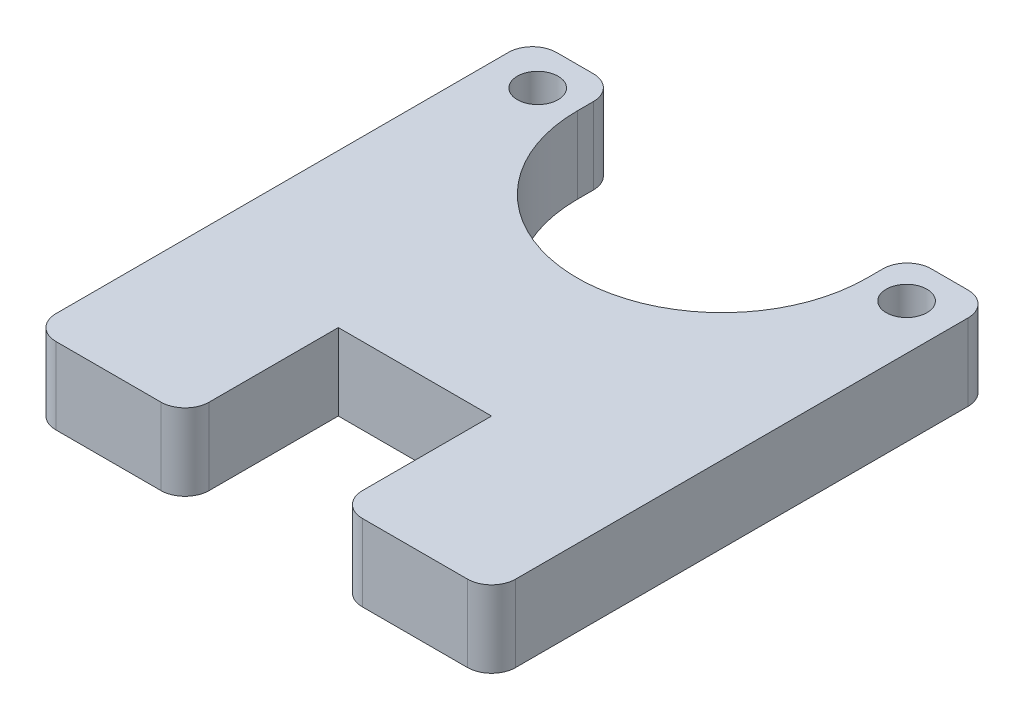
ISO-10303-21;
HEADER;
FILE_DESCRIPTION(('STEP AP214'),'2;1');
FILE_NAME('part.step','',(''),(''),'','','');
FILE_SCHEMA(('AUTOMOTIVE_DESIGN { 1 0 10303 214 1 1 1 1 }'));
ENDSEC;
DATA;
#1=APPLICATION_CONTEXT('core data for automotive mechanical design processes');
#2=APPLICATION_PROTOCOL_DEFINITION('international standard','automotive_design',2000,#1);
#3=PRODUCT_CONTEXT('',#1,'mechanical');
#4=PRODUCT('Part','Part','',(#3));
#5=PRODUCT_RELATED_PRODUCT_CATEGORY('part','',(#4));
#6=PRODUCT_DEFINITION_FORMATION('','',#4);
#7=PRODUCT_DEFINITION_CONTEXT('part definition',#1,'design');
#8=PRODUCT_DEFINITION('design','',#6,#7);
#9=PRODUCT_DEFINITION_SHAPE('','',#8);
#10=(LENGTH_UNIT() NAMED_UNIT(*) SI_UNIT(.MILLI.,.METRE.));
#11=(NAMED_UNIT(*) PLANE_ANGLE_UNIT() SI_UNIT($,.RADIAN.));
#12=(NAMED_UNIT(*) SI_UNIT($,.STERADIAN.) SOLID_ANGLE_UNIT());
#13=UNCERTAINTY_MEASURE_WITH_UNIT(LENGTH_MEASURE(1.E-05),#10,'distance_accuracy_value','');
#14=(GEOMETRIC_REPRESENTATION_CONTEXT(3) GLOBAL_UNCERTAINTY_ASSIGNED_CONTEXT((#13)) GLOBAL_UNIT_ASSIGNED_CONTEXT((#10,
#11,#12)) REPRESENTATION_CONTEXT('',''));
#15=CARTESIAN_POINT('',(0.,0.,0.));
#16=DIRECTION('',(0.,0.,1.));
#17=DIRECTION('',(1.,0.,0.));
#18=AXIS2_PLACEMENT_3D('',#15,#16,#17);
#19=CARTESIAN_POINT('',(19.05,3.175,0.));
#20=DIRECTION('',(-1.,0.,0.));
#21=DIRECTION('',(0.,0.,1.));
#22=AXIS2_PLACEMENT_3D('',#19,#20,#21);
#23=PLANE('',#22);
#24=DIRECTION('',(0.,0.,-1.));
#25=VECTOR('',#24,1.);
#26=CARTESIAN_POINT('',(19.05,3.175,0.));
#27=LINE('',#26,#25);
#28=CARTESIAN_POINT('',(19.05,3.175,5.35));
#29=VERTEX_POINT('',#28);
#30=CARTESIAN_POINT('',(19.05,3.175,-13.393639996));
#31=VERTEX_POINT('',#30);
#32=EDGE_CURVE('E269',#29,#31,#27,.T.);
#33=ORIENTED_EDGE('',*,*,#32,.F.);
#34=DIRECTION('',(0.,-1.,0.));
#35=VECTOR('',#34,1.);
#36=CARTESIAN_POINT('',(19.05,0.,5.35));
#37=LINE('',#36,#35);
#38=CARTESIAN_POINT('',(19.05,0.,5.35));
#39=VERTEX_POINT('',#38);
#40=EDGE_CURVE('E276',#29,#39,#37,.T.);
#41=ORIENTED_EDGE('',*,*,#40,.T.);
#42=DIRECTION('',(0.,0.,-1.));
#43=VECTOR('',#42,1.);
#44=CARTESIAN_POINT('',(19.05,0.,0.));
#45=LINE('',#44,#43);
#46=CARTESIAN_POINT('',(19.05,0.,-13.393639996));
#47=VERTEX_POINT('',#46);
#48=EDGE_CURVE('E232',#39,#47,#45,.T.);
#49=ORIENTED_EDGE('',*,*,#48,.T.);
#50=DIRECTION('',(0.,-1.,0.));
#51=VECTOR('',#50,1.);
#52=CARTESIAN_POINT('',(19.05,3.175,-13.393639996));
#53=LINE('',#52,#51);
#54=EDGE_CURVE('E187',#47,#31,#53,.F.);
#55=ORIENTED_EDGE('',*,*,#54,.T.);
#56=EDGE_LOOP('',(#33,#41,#49,#55));
#57=FACE_BOUND('',#56,.T.);
#58=ADVANCED_FACE('F35',(#57),#23,.F.);
#59=CARTESIAN_POINT('',(0.,3.175,-14.393639996));
#60=DIRECTION('',(0.,0.,1.));
#61=DIRECTION('',(1.,0.,0.));
#62=AXIS2_PLACEMENT_3D('',#59,#60,#61);
#63=PLANE('',#62);
#64=DIRECTION('',(-1.,0.,0.));
#65=VECTOR('',#64,1.);
#66=CARTESIAN_POINT('',(0.,3.175,-14.393639996));
#67=LINE('',#66,#65);
#68=CARTESIAN_POINT('',(18.05,3.175,-14.393639996));
#69=VERTEX_POINT('',#68);
#70=CARTESIAN_POINT('',(16.5250007,3.175,-14.393639996));
#71=VERTEX_POINT('',#70);
#72=EDGE_CURVE('E199',#69,#71,#67,.T.);
#73=ORIENTED_EDGE('',*,*,#72,.F.);
#74=DIRECTION('',(0.,-1.,0.));
#75=VECTOR('',#74,1.);
#76=CARTESIAN_POINT('',(18.05,3.175,-14.393639996));
#77=LINE('',#76,#75);
#78=CARTESIAN_POINT('',(18.05,0.,-14.393639996));
#79=VERTEX_POINT('',#78);
#80=EDGE_CURVE('E330',#69,#79,#77,.T.);
#81=ORIENTED_EDGE('',*,*,#80,.T.);
#82=DIRECTION('',(-1.,0.,0.));
#83=VECTOR('',#82,1.);
#84=CARTESIAN_POINT('',(0.,0.,-14.393639996));
#85=LINE('',#84,#83);
#86=CARTESIAN_POINT('',(16.5250007,0.,-14.393639996));
#87=VERTEX_POINT('',#86);
#88=EDGE_CURVE('E235',#79,#87,#85,.T.);
#89=ORIENTED_EDGE('',*,*,#88,.T.);
#90=DIRECTION('',(0.,-1.,0.));
#91=VECTOR('',#90,1.);
#92=CARTESIAN_POINT('',(16.5250007,3.175,-14.393639996));
#93=LINE('',#92,#91);
#94=EDGE_CURVE('E328',#87,#71,#93,.F.);
#95=ORIENTED_EDGE('',*,*,#94,.T.);
#96=EDGE_LOOP('',(#73,#81,#89,#95));
#97=FACE_BOUND('',#96,.T.);
#98=ADVANCED_FACE('F394',(#97),#63,.F.);
#99=CARTESIAN_POINT('',(15.5250007,3.175,0.));
#100=DIRECTION('',(-1.,0.,0.));
#101=DIRECTION('',(0.,0.,1.));
#102=AXIS2_PLACEMENT_3D('',#99,#100,#101);
#103=PLANE('',#102);
#104=DIRECTION('',(0.,0.,-1.));
#105=VECTOR('',#104,1.);
#106=CARTESIAN_POINT('',(15.5250007,3.175,0.));
#107=LINE('',#106,#105);
#108=CARTESIAN_POINT('',(15.5250007,3.175,-12.728637738));
#109=VERTEX_POINT('',#108);
#110=CARTESIAN_POINT('',(15.5250007,3.175,-13.393639996));
#111=VERTEX_POINT('',#110);
#112=EDGE_CURVE('E179',#109,#111,#107,.T.);
#113=ORIENTED_EDGE('',*,*,#112,.T.);
#114=DIRECTION('',(0.,-1.,0.));
#115=VECTOR('',#114,1.);
#116=CARTESIAN_POINT('',(15.5250007,0.,-13.393639996));
#117=LINE('',#116,#115);
#118=CARTESIAN_POINT('',(15.5250007,0.,-13.393639996));
#119=VERTEX_POINT('',#118);
#120=EDGE_CURVE('E333',#111,#119,#117,.T.);
#121=ORIENTED_EDGE('',*,*,#120,.T.);
#122=DIRECTION('',(0.,0.,-1.));
#123=VECTOR('',#122,1.);
#124=CARTESIAN_POINT('',(15.5250007,0.,0.));
#125=LINE('',#124,#123);
#126=CARTESIAN_POINT('',(15.5250007,0.,-12.728637738));
#127=VERTEX_POINT('',#126);
#128=EDGE_CURVE('E182',#127,#119,#125,.T.);
#129=ORIENTED_EDGE('',*,*,#128,.F.);
#130=DIRECTION('',(0.,-1.,0.));
#131=VECTOR('',#130,1.);
#132=CARTESIAN_POINT('',(15.5250007,3.175,-12.728637738));
#133=LINE('',#132,#131);
#134=EDGE_CURVE('E175',#109,#127,#133,.T.);
#135=ORIENTED_EDGE('',*,*,#134,.F.);
#136=EDGE_LOOP('',(#113,#121,#129,#135));
#137=FACE_BOUND('',#136,.T.);
#138=ADVANCED_FACE('F177',(#137),#103,.T.);
#139=CARTESIAN_POINT('',(9.525,3.175,-12.728637738));
#140=DIRECTION('',(0.,-1.,0.));
#141=DIRECTION('',(0.,0.,-1.));
#142=AXIS2_PLACEMENT_3D('',#139,#140,#141);
#143=CYLINDRICAL_SURFACE('',#142,6.0000007);
#144=CARTESIAN_POINT('',(9.525,0.,-12.728637738));
#145=DIRECTION('',(0.,1.,0.));
#146=DIRECTION('',(0.,0.,1.));
#147=AXIS2_PLACEMENT_3D('',#144,#145,#146);
#148=CIRCLE('',#147,6.0000007);
#149=CARTESIAN_POINT('',(3.52499930000392,0.,-12.728637738));
#150=VERTEX_POINT('',#149);
#151=EDGE_CURVE('E239',#150,#127,#148,.T.);
#152=ORIENTED_EDGE('',*,*,#151,.F.);
#153=DIRECTION('',(0.,-1.,0.));
#154=VECTOR('',#153,1.);
#155=CARTESIAN_POINT('',(3.52499930000392,3.175,-12.728637738));
#156=LINE('',#155,#154);
#157=CARTESIAN_POINT('',(3.52499930000392,3.175,-12.728637738));
#158=VERTEX_POINT('',#157);
#159=EDGE_CURVE('E188',#158,#150,#156,.T.);
#160=ORIENTED_EDGE('',*,*,#159,.F.);
#161=CARTESIAN_POINT('',(9.525,3.175,-12.728637738));
#162=DIRECTION('',(0.,1.,0.));
#163=DIRECTION('',(0.,0.,1.));
#164=AXIS2_PLACEMENT_3D('',#161,#162,#163);
#165=CIRCLE('',#164,6.0000007);
#166=EDGE_CURVE('E195',#158,#109,#165,.T.);
#167=ORIENTED_EDGE('',*,*,#166,.T.);
#168=ORIENTED_EDGE('',*,*,#134,.T.);
#169=EDGE_LOOP('',(#152,#160,#167,#168));
#170=FACE_BOUND('',#169,.T.);
#171=ADVANCED_FACE('F201',(#170),#143,.F.);
#172=CARTESIAN_POINT('',(3.52499930000392,3.175,0.));
#173=DIRECTION('',(-1.,0.,0.));
#174=DIRECTION('',(0.,0.,1.));
#175=AXIS2_PLACEMENT_3D('',#172,#173,#174);
#176=PLANE('',#175);
#177=DIRECTION('',(0.,0.,-1.));
#178=VECTOR('',#177,1.);
#179=CARTESIAN_POINT('',(3.52499930000392,0.,0.));
#180=LINE('',#179,#178);
#181=CARTESIAN_POINT('',(3.52499930000392,0.,-13.393639996));
#182=VERTEX_POINT('',#181);
#183=EDGE_CURVE('E241',#150,#182,#180,.T.);
#184=ORIENTED_EDGE('',*,*,#183,.T.);
#185=DIRECTION('',(0.,-1.,0.));
#186=VECTOR('',#185,1.);
#187=CARTESIAN_POINT('',(3.52499930000392,3.175,-13.393639996));
#188=LINE('',#187,#186);
#189=CARTESIAN_POINT('',(3.52499930000392,3.175,-13.393639996));
#190=VERTEX_POINT('',#189);
#191=EDGE_CURVE('E11',#182,#190,#188,.F.);
#192=ORIENTED_EDGE('',*,*,#191,.T.);
#193=DIRECTION('',(0.,0.,-1.));
#194=VECTOR('',#193,1.);
#195=CARTESIAN_POINT('',(3.52499930000392,3.175,0.));
#196=LINE('',#195,#194);
#197=EDGE_CURVE('E203',#158,#190,#196,.T.);
#198=ORIENTED_EDGE('',*,*,#197,.F.);
#199=ORIENTED_EDGE('',*,*,#159,.T.);
#200=EDGE_LOOP('',(#184,#192,#198,#199));
#201=FACE_BOUND('',#200,.T.);
#202=ADVANCED_FACE('F431',(#201),#176,.F.);
#203=CARTESIAN_POINT('',(0.,3.175,-14.393639996));
#204=DIRECTION('',(0.,0.,-1.));
#205=DIRECTION('',(-1.,0.,0.));
#206=AXIS2_PLACEMENT_3D('',#203,#204,#205);
#207=PLANE('',#206);
#208=DIRECTION('',(1.,0.,0.));
#209=VECTOR('',#208,1.);
#210=CARTESIAN_POINT('',(0.,3.175,-14.393639996));
#211=LINE('',#210,#209);
#212=CARTESIAN_POINT('',(1.,3.175,-14.393639996));
#213=VERTEX_POINT('',#212);
#214=CARTESIAN_POINT('',(2.52499930000392,3.175,-14.393639996));
#215=VERTEX_POINT('',#214);
#216=EDGE_CURVE('E205',#213,#215,#211,.T.);
#217=ORIENTED_EDGE('',*,*,#216,.T.);
#218=DIRECTION('',(0.,-1.,0.));
#219=VECTOR('',#218,1.);
#220=CARTESIAN_POINT('',(2.52499930000392,0.,-14.393639996));
#221=LINE('',#220,#219);
#222=CARTESIAN_POINT('',(2.52499930000392,0.,-14.393639996));
#223=VERTEX_POINT('',#222);
#224=EDGE_CURVE('E43',#215,#223,#221,.T.);
#225=ORIENTED_EDGE('',*,*,#224,.T.);
#226=DIRECTION('',(1.,0.,0.));
#227=VECTOR('',#226,1.);
#228=CARTESIAN_POINT('',(0.,0.,-14.393639996));
#229=LINE('',#228,#227);
#230=CARTESIAN_POINT('',(1.,0.,-14.393639996));
#231=VERTEX_POINT('',#230);
#232=EDGE_CURVE('E244',#231,#223,#229,.T.);
#233=ORIENTED_EDGE('',*,*,#232,.F.);
#234=DIRECTION('',(0.,-1.,0.));
#235=VECTOR('',#234,1.);
#236=CARTESIAN_POINT('',(1.,3.175,-14.393639996));
#237=LINE('',#236,#235);
#238=EDGE_CURVE('E335',#231,#213,#237,.F.);
#239=ORIENTED_EDGE('',*,*,#238,.T.);
#240=EDGE_LOOP('',(#217,#225,#233,#239));
#241=FACE_BOUND('',#240,.T.);
#242=ADVANCED_FACE('F340',(#241),#207,.T.);
#243=CARTESIAN_POINT('',(0.,3.175,0.));
#244=DIRECTION('',(-1.,0.,0.));
#245=DIRECTION('',(0.,0.,1.));
#246=AXIS2_PLACEMENT_3D('',#243,#244,#245);
#247=PLANE('',#246);
#248=DIRECTION('',(0.,0.,-1.));
#249=VECTOR('',#248,1.);
#250=CARTESIAN_POINT('',(0.,0.,0.));
#251=LINE('',#250,#249);
#252=CARTESIAN_POINT('',(0.,0.,5.35));
#253=VERTEX_POINT('',#252);
#254=CARTESIAN_POINT('',(0.,0.,-13.393639996));
#255=VERTEX_POINT('',#254);
#256=EDGE_CURVE('E247',#253,#255,#251,.T.);
#257=ORIENTED_EDGE('',*,*,#256,.F.);
#258=DIRECTION('',(0.,-1.,0.));
#259=VECTOR('',#258,1.);
#260=CARTESIAN_POINT('',(0.,3.175,5.35));
#261=LINE('',#260,#259);
#262=CARTESIAN_POINT('',(0.,3.175,5.35));
#263=VERTEX_POINT('',#262);
#264=EDGE_CURVE('E326',#253,#263,#261,.F.);
#265=ORIENTED_EDGE('',*,*,#264,.T.);
#266=DIRECTION('',(0.,0.,-1.));
#267=VECTOR('',#266,1.);
#268=CARTESIAN_POINT('',(0.,3.175,0.));
#269=LINE('',#268,#267);
#270=CARTESIAN_POINT('',(0.,3.175,-13.393639996));
#271=VERTEX_POINT('',#270);
#272=EDGE_CURVE('E211',#263,#271,#269,.T.);
#273=ORIENTED_EDGE('',*,*,#272,.T.);
#274=DIRECTION('',(0.,-1.,0.));
#275=VECTOR('',#274,1.);
#276=CARTESIAN_POINT('',(0.,3.175,-13.393639996));
#277=LINE('',#276,#275);
#278=EDGE_CURVE('E323',#271,#255,#277,.T.);
#279=ORIENTED_EDGE('',*,*,#278,.T.);
#280=EDGE_LOOP('',(#257,#265,#273,#279));
#281=FACE_BOUND('',#280,.T.);
#282=ADVANCED_FACE('F355',(#281),#247,.T.);
#283=CARTESIAN_POINT('',(0.,3.175,6.35));
#284=DIRECTION('',(0.,0.,-1.));
#285=DIRECTION('',(-1.,0.,0.));
#286=AXIS2_PLACEMENT_3D('',#283,#284,#285);
#287=PLANE('',#286);
#288=DIRECTION('',(1.,0.,0.));
#289=VECTOR('',#288,1.);
#290=CARTESIAN_POINT('',(0.,0.,6.35));
#291=LINE('',#290,#289);
#292=CARTESIAN_POINT('',(1.00000000000001,0.,6.35));
#293=VERTEX_POINT('',#292);
#294=CARTESIAN_POINT('',(5.35,0.,6.35));
#295=VERTEX_POINT('',#294);
#296=EDGE_CURVE('E250',#293,#295,#291,.T.);
#297=ORIENTED_EDGE('',*,*,#296,.T.);
#298=DIRECTION('',(0.,-1.,0.));
#299=VECTOR('',#298,1.);
#300=CARTESIAN_POINT('',(5.35,3.175,6.35));
#301=LINE('',#300,#299);
#302=CARTESIAN_POINT('',(5.35,3.175,6.35));
#303=VERTEX_POINT('',#302);
#304=EDGE_CURVE('E321',#295,#303,#301,.F.);
#305=ORIENTED_EDGE('',*,*,#304,.T.);
#306=DIRECTION('',(1.,0.,0.));
#307=VECTOR('',#306,1.);
#308=CARTESIAN_POINT('',(0.,3.175,6.35));
#309=LINE('',#308,#307);
#310=CARTESIAN_POINT('',(1.00000000000001,3.175,6.35));
#311=VERTEX_POINT('',#310);
#312=EDGE_CURVE('E214',#311,#303,#309,.T.);
#313=ORIENTED_EDGE('',*,*,#312,.F.);
#314=DIRECTION('',(0.,-1.,0.));
#315=VECTOR('',#314,1.);
#316=CARTESIAN_POINT('',(1.00000000000001,0.,6.35));
#317=LINE('',#316,#315);
#318=EDGE_CURVE('E318',#311,#293,#317,.T.);
#319=ORIENTED_EDGE('',*,*,#318,.T.);
#320=EDGE_LOOP('',(#297,#305,#313,#319));
#321=FACE_BOUND('',#320,.T.);
#322=ADVANCED_FACE('F365',(#321),#287,.F.);
#323=CARTESIAN_POINT('',(6.35,3.175,0.));
#324=DIRECTION('',(1.,0.,0.));
#325=DIRECTION('',(0.,0.,-1.));
#326=AXIS2_PLACEMENT_3D('',#323,#324,#325);
#327=PLANE('',#326);
#328=DIRECTION('',(0.,0.,1.));
#329=VECTOR('',#328,1.);
#330=CARTESIAN_POINT('',(6.35,3.175,0.));
#331=LINE('',#330,#329);
#332=CARTESIAN_POINT('',(6.35,3.175,0.));
#333=VERTEX_POINT('',#332);
#334=CARTESIAN_POINT('',(6.35,3.175,5.35));
#335=VERTEX_POINT('',#334);
#336=EDGE_CURVE('E216',#333,#335,#331,.T.);
#337=ORIENTED_EDGE('',*,*,#336,.T.);
#338=DIRECTION('',(0.,-1.,0.));
#339=VECTOR('',#338,1.);
#340=CARTESIAN_POINT('',(6.35,0.,5.35));
#341=LINE('',#340,#339);
#342=CARTESIAN_POINT('',(6.35,0.,5.35));
#343=VERTEX_POINT('',#342);
#344=EDGE_CURVE('E315',#335,#343,#341,.T.);
#345=ORIENTED_EDGE('',*,*,#344,.T.);
#346=DIRECTION('',(0.,0.,1.));
#347=VECTOR('',#346,1.);
#348=CARTESIAN_POINT('',(6.35,0.,0.));
#349=LINE('',#348,#347);
#350=CARTESIAN_POINT('',(6.35,0.,0.));
#351=VERTEX_POINT('',#350);
#352=EDGE_CURVE('E253',#351,#343,#349,.T.);
#353=ORIENTED_EDGE('',*,*,#352,.F.);
#354=DIRECTION('',(0.,-1.,0.));
#355=VECTOR('',#354,1.);
#356=CARTESIAN_POINT('',(6.35,3.175,0.));
#357=LINE('',#356,#355);
#358=EDGE_CURVE('E272',#333,#351,#357,.T.);
#359=ORIENTED_EDGE('',*,*,#358,.F.);
#360=EDGE_LOOP('',(#337,#345,#353,#359));
#361=FACE_BOUND('',#360,.T.);
#362=ADVANCED_FACE('F373',(#361),#327,.T.);
#363=CARTESIAN_POINT('',(0.,3.175,0.));
#364=DIRECTION('',(0.,0.,-1.));
#365=DIRECTION('',(-1.,0.,0.));
#366=AXIS2_PLACEMENT_3D('',#363,#364,#365);
#367=PLANE('',#366);
#368=DIRECTION('',(1.,0.,0.));
#369=VECTOR('',#368,1.);
#370=CARTESIAN_POINT('',(0.,0.,0.));
#371=LINE('',#370,#369);
#372=CARTESIAN_POINT('',(12.7,0.,0.));
#373=VERTEX_POINT('',#372);
#374=EDGE_CURVE('E256',#351,#373,#371,.T.);
#375=ORIENTED_EDGE('',*,*,#374,.T.);
#376=DIRECTION('',(0.,-1.,0.));
#377=VECTOR('',#376,1.);
#378=CARTESIAN_POINT('',(12.7,3.175,0.));
#379=LINE('',#378,#377);
#380=CARTESIAN_POINT('',(12.7,3.175,0.));
#381=VERTEX_POINT('',#380);
#382=EDGE_CURVE('E231',#381,#373,#379,.T.);
#383=ORIENTED_EDGE('',*,*,#382,.F.);
#384=DIRECTION('',(1.,0.,0.));
#385=VECTOR('',#384,1.);
#386=CARTESIAN_POINT('',(0.,3.175,0.));
#387=LINE('',#386,#385);
#388=EDGE_CURVE('E218',#333,#381,#387,.T.);
#389=ORIENTED_EDGE('',*,*,#388,.F.);
#390=ORIENTED_EDGE('',*,*,#358,.T.);
#391=EDGE_LOOP('',(#375,#383,#389,#390));
#392=FACE_BOUND('',#391,.T.);
#393=ADVANCED_FACE('F378',(#392),#367,.F.);
#394=CARTESIAN_POINT('',(12.7,3.175,0.));
#395=DIRECTION('',(1.,0.,0.));
#396=DIRECTION('',(0.,0.,-1.));
#397=AXIS2_PLACEMENT_3D('',#394,#395,#396);
#398=PLANE('',#397);
#399=DIRECTION('',(0.,0.,1.));
#400=VECTOR('',#399,1.);
#401=CARTESIAN_POINT('',(12.7,0.,0.));
#402=LINE('',#401,#400);
#403=CARTESIAN_POINT('',(12.7,0.,5.35));
#404=VERTEX_POINT('',#403);
#405=EDGE_CURVE('E258',#373,#404,#402,.T.);
#406=ORIENTED_EDGE('',*,*,#405,.T.);
#407=DIRECTION('',(0.,-1.,0.));
#408=VECTOR('',#407,1.);
#409=CARTESIAN_POINT('',(12.7,3.175,5.35));
#410=LINE('',#409,#408);
#411=CARTESIAN_POINT('',(12.7,3.175,5.35));
#412=VERTEX_POINT('',#411);
#413=EDGE_CURVE('E50',#404,#412,#410,.F.);
#414=ORIENTED_EDGE('',*,*,#413,.T.);
#415=DIRECTION('',(0.,0.,1.));
#416=VECTOR('',#415,1.);
#417=CARTESIAN_POINT('',(12.7,3.175,0.));
#418=LINE('',#417,#416);
#419=EDGE_CURVE('E220',#381,#412,#418,.T.);
#420=ORIENTED_EDGE('',*,*,#419,.F.);
#421=ORIENTED_EDGE('',*,*,#382,.T.);
#422=EDGE_LOOP('',(#406,#414,#420,#421));
#423=FACE_BOUND('',#422,.T.);
#424=ADVANCED_FACE('F380',(#423),#398,.F.);
#425=CARTESIAN_POINT('',(1.88250068000392,3.175,-12.728644596));
#426=DIRECTION('',(0.,-1.,0.));
#427=DIRECTION('',(0.,0.,-1.));
#428=AXIS2_PLACEMENT_3D('',#425,#426,#427);
#429=CYLINDRICAL_SURFACE('',#428,0.8449945);
#430=CARTESIAN_POINT('',(1.88250068000392,3.175,-12.728644596));
#431=DIRECTION('',(0.,1.,0.));
#432=DIRECTION('',(0.,0.,1.));
#433=AXIS2_PLACEMENT_3D('',#430,#431,#432);
#434=CIRCLE('',#433,0.8449945);
#435=CARTESIAN_POINT('',(1.88250068000392,3.175,-11.883650096));
#436=VERTEX_POINT('',#435);
#437=EDGE_CURVE('E225',#436,#436,#434,.T.);
#438=ORIENTED_EDGE('',*,*,#437,.T.);
#439=EDGE_LOOP('',(#438));
#440=FACE_BOUND('',#439,.T.);
#441=CARTESIAN_POINT('',(1.88250068000392,0.,-12.728644596));
#442=DIRECTION('',(0.,1.,0.));
#443=DIRECTION('',(0.,0.,1.));
#444=AXIS2_PLACEMENT_3D('',#441,#442,#443);
#445=CIRCLE('',#444,0.8449945);
#446=CARTESIAN_POINT('',(1.88250068000392,0.,-11.883650096));
#447=VERTEX_POINT('',#446);
#448=EDGE_CURVE('E263',#447,#447,#445,.T.);
#449=ORIENTED_EDGE('',*,*,#448,.F.);
#450=EDGE_LOOP('',(#449));
#451=FACE_BOUND('',#450,.T.);
#452=ADVANCED_FACE('F382',(#440,#451),#429,.F.);
#453=CARTESIAN_POINT('',(0.,3.175,6.35));
#454=DIRECTION('',(0.,0.,1.));
#455=DIRECTION('',(1.,0.,0.));
#456=AXIS2_PLACEMENT_3D('',#453,#454,#455);
#457=PLANE('',#456);
#458=DIRECTION('',(-1.,0.,0.));
#459=VECTOR('',#458,1.);
#460=CARTESIAN_POINT('',(0.,0.,6.35));
#461=LINE('',#460,#459);
#462=CARTESIAN_POINT('',(18.05,0.,6.35));
#463=VERTEX_POINT('',#462);
#464=CARTESIAN_POINT('',(13.7,0.,6.35));
#465=VERTEX_POINT('',#464);
#466=EDGE_CURVE('E260',#463,#465,#461,.T.);
#467=ORIENTED_EDGE('',*,*,#466,.F.);
#468=DIRECTION('',(0.,-1.,0.));
#469=VECTOR('',#468,1.);
#470=CARTESIAN_POINT('',(18.05,3.175,6.35));
#471=LINE('',#470,#469);
#472=CARTESIAN_POINT('',(18.05,3.175,6.35));
#473=VERTEX_POINT('',#472);
#474=EDGE_CURVE('E298',#463,#473,#471,.F.);
#475=ORIENTED_EDGE('',*,*,#474,.T.);
#476=DIRECTION('',(-1.,0.,0.));
#477=VECTOR('',#476,1.);
#478=CARTESIAN_POINT('',(0.,3.175,6.35));
#479=LINE('',#478,#477);
#480=CARTESIAN_POINT('',(13.7,3.175,6.35));
#481=VERTEX_POINT('',#480);
#482=EDGE_CURVE('E222',#473,#481,#479,.T.);
#483=ORIENTED_EDGE('',*,*,#482,.T.);
#484=DIRECTION('',(0.,-1.,0.));
#485=VECTOR('',#484,1.);
#486=CARTESIAN_POINT('',(13.7,0.,6.35));
#487=LINE('',#486,#485);
#488=EDGE_CURVE('E295',#481,#465,#487,.T.);
#489=ORIENTED_EDGE('',*,*,#488,.T.);
#490=EDGE_LOOP('',(#467,#475,#483,#489));
#491=FACE_BOUND('',#490,.T.);
#492=ADVANCED_FACE('F388',(#491),#457,.T.);
#493=CARTESIAN_POINT('',(17.16749932,3.175,-12.728637738));
#494=DIRECTION('',(0.,-1.,0.));
#495=DIRECTION('',(0.,0.,-1.));
#496=AXIS2_PLACEMENT_3D('',#493,#494,#495);
#497=CYLINDRICAL_SURFACE('',#496,0.844994500000003);
#498=CARTESIAN_POINT('',(17.16749932,3.175,-12.728637738));
#499=DIRECTION('',(0.,1.,0.));
#500=DIRECTION('',(0.,0.,1.));
#501=AXIS2_PLACEMENT_3D('',#498,#499,#500);
#502=CIRCLE('',#501,0.844994500000003);
#503=CARTESIAN_POINT('',(17.16749932,3.175,-11.883643238));
#504=VERTEX_POINT('',#503);
#505=EDGE_CURVE('E228',#504,#504,#502,.T.);
#506=ORIENTED_EDGE('',*,*,#505,.T.);
#507=EDGE_LOOP('',(#506));
#508=FACE_BOUND('',#507,.T.);
#509=CARTESIAN_POINT('',(17.16749932,0.,-12.728637738));
#510=DIRECTION('',(0.,1.,0.));
#511=DIRECTION('',(0.,0.,1.));
#512=AXIS2_PLACEMENT_3D('',#509,#510,#511);
#513=CIRCLE('',#512,0.844994500000003);
#514=CARTESIAN_POINT('',(17.16749932,0.,-11.883643238));
#515=VERTEX_POINT('',#514);
#516=EDGE_CURVE('E266',#515,#515,#513,.T.);
#517=ORIENTED_EDGE('',*,*,#516,.F.);
#518=EDGE_LOOP('',(#517));
#519=FACE_BOUND('',#518,.T.);
#520=ADVANCED_FACE('F447',(#508,#519),#497,.F.);
#521=CARTESIAN_POINT('',(0.,3.175,0.));
#522=DIRECTION('',(0.,1.,0.));
#523=DIRECTION('',(0.,0.,1.));
#524=AXIS2_PLACEMENT_3D('',#521,#522,#523);
#525=PLANE('',#524);
#526=ORIENTED_EDGE('',*,*,#482,.F.);
#527=CARTESIAN_POINT('',(18.05,3.175,5.35));
#528=DIRECTION('',(0.,1.,0.));
#529=DIRECTION('',(0.,0.,1.));
#530=AXIS2_PLACEMENT_3D('',#527,#528,#529);
#531=CIRCLE('',#530,1.);
#532=EDGE_CURVE('E312',#473,#29,#531,.T.);
#533=ORIENTED_EDGE('',*,*,#532,.T.);
#534=ORIENTED_EDGE('',*,*,#32,.T.);
#535=CARTESIAN_POINT('',(18.05,3.175,-13.393639996));
#536=DIRECTION('',(0.,1.,0.));
#537=DIRECTION('',(0.,0.,1.));
#538=AXIS2_PLACEMENT_3D('',#535,#536,#537);
#539=CIRCLE('',#538,1.);
#540=EDGE_CURVE('E305',#31,#69,#539,.T.);
#541=ORIENTED_EDGE('',*,*,#540,.T.);
#542=ORIENTED_EDGE('',*,*,#72,.T.);
#543=CARTESIAN_POINT('',(16.5250007,3.175,-13.393639996));
#544=DIRECTION('',(0.,1.,0.));
#545=DIRECTION('',(0.,0.,1.));
#546=AXIS2_PLACEMENT_3D('',#543,#544,#545);
#547=CIRCLE('',#546,1.);
#548=EDGE_CURVE('E198',#71,#111,#547,.T.);
#549=ORIENTED_EDGE('',*,*,#548,.T.);
#550=ORIENTED_EDGE('',*,*,#112,.F.);
#551=ORIENTED_EDGE('',*,*,#166,.F.);
#552=ORIENTED_EDGE('',*,*,#197,.T.);
#553=CARTESIAN_POINT('',(2.52499930000392,3.175,-13.393639996));
#554=DIRECTION('',(0.,1.,0.));
#555=DIRECTION('',(0.,0.,1.));
#556=AXIS2_PLACEMENT_3D('',#553,#554,#555);
#557=CIRCLE('',#556,1.);
#558=EDGE_CURVE('E302',#190,#215,#557,.T.);
#559=ORIENTED_EDGE('',*,*,#558,.T.);
#560=ORIENTED_EDGE('',*,*,#216,.F.);
#561=CARTESIAN_POINT('',(1.,3.175,-13.393639996));
#562=DIRECTION('',(0.,1.,0.));
#563=DIRECTION('',(0.,0.,1.));
#564=AXIS2_PLACEMENT_3D('',#561,#562,#563);
#565=CIRCLE('',#564,1.);
#566=EDGE_CURVE('E300',#213,#271,#565,.T.);
#567=ORIENTED_EDGE('',*,*,#566,.T.);
#568=ORIENTED_EDGE('',*,*,#272,.F.);
#569=CARTESIAN_POINT('',(1.00000000000001,3.175,5.35));
#570=DIRECTION('',(0.,1.,0.));
#571=DIRECTION('',(0.,0.,1.));
#572=AXIS2_PLACEMENT_3D('',#569,#570,#571);
#573=CIRCLE('',#572,1.);
#574=EDGE_CURVE('E307',#263,#311,#573,.T.);
#575=ORIENTED_EDGE('',*,*,#574,.T.);
#576=ORIENTED_EDGE('',*,*,#312,.T.);
#577=CARTESIAN_POINT('',(5.35,3.175,5.35));
#578=DIRECTION('',(0.,1.,0.));
#579=DIRECTION('',(0.,0.,1.));
#580=AXIS2_PLACEMENT_3D('',#577,#578,#579);
#581=CIRCLE('',#580,1.);
#582=EDGE_CURVE('E58',#303,#335,#581,.T.);
#583=ORIENTED_EDGE('',*,*,#582,.T.);
#584=ORIENTED_EDGE('',*,*,#336,.F.);
#585=ORIENTED_EDGE('',*,*,#388,.T.);
#586=ORIENTED_EDGE('',*,*,#419,.T.);
#587=CARTESIAN_POINT('',(13.7,3.175,5.35));
#588=DIRECTION('',(0.,1.,0.));
#589=DIRECTION('',(0.,0.,1.));
#590=AXIS2_PLACEMENT_3D('',#587,#588,#589);
#591=CIRCLE('',#590,1.);
#592=EDGE_CURVE('E310',#412,#481,#591,.T.);
#593=ORIENTED_EDGE('',*,*,#592,.T.);
#594=EDGE_LOOP('',(#526,#533,#534,#541,#542,#549,#550,#551,#552,#559,#560,#567,#568,#575,#576,
#583,#584,#585,#586,#593));
#595=FACE_BOUND('',#594,.T.);
#596=ORIENTED_EDGE('',*,*,#437,.F.);
#597=EDGE_LOOP('',(#596));
#598=FACE_BOUND('',#597,.T.);
#599=ORIENTED_EDGE('',*,*,#505,.F.);
#600=EDGE_LOOP('',(#599));
#601=FACE_BOUND('',#600,.T.);
#602=ADVANCED_FACE('F192',(#595,#598,#601),#525,.T.);
#603=CARTESIAN_POINT('',(0.,0.,0.));
#604=DIRECTION('',(0.,1.,0.));
#605=DIRECTION('',(0.,0.,1.));
#606=AXIS2_PLACEMENT_3D('',#603,#604,#605);
#607=PLANE('',#606);
#608=ORIENTED_EDGE('',*,*,#48,.F.);
#609=CARTESIAN_POINT('',(18.05,0.,5.35));
#610=DIRECTION('',(0.,1.,0.));
#611=DIRECTION('',(0.,0.,1.));
#612=AXIS2_PLACEMENT_3D('',#609,#610,#611);
#613=CIRCLE('',#612,1.);
#614=EDGE_CURVE('E293',#39,#463,#613,.F.);
#615=ORIENTED_EDGE('',*,*,#614,.T.);
#616=ORIENTED_EDGE('',*,*,#466,.T.);
#617=CARTESIAN_POINT('',(13.7,0.,5.35));
#618=DIRECTION('',(0.,1.,0.));
#619=DIRECTION('',(0.,0.,1.));
#620=AXIS2_PLACEMENT_3D('',#617,#618,#619);
#621=CIRCLE('',#620,1.);
#622=EDGE_CURVE('E291',#465,#404,#621,.F.);
#623=ORIENTED_EDGE('',*,*,#622,.T.);
#624=ORIENTED_EDGE('',*,*,#405,.F.);
#625=ORIENTED_EDGE('',*,*,#374,.F.);
#626=ORIENTED_EDGE('',*,*,#352,.T.);
#627=CARTESIAN_POINT('',(5.35,0.,5.35));
#628=DIRECTION('',(0.,1.,0.));
#629=DIRECTION('',(0.,0.,1.));
#630=AXIS2_PLACEMENT_3D('',#627,#628,#629);
#631=CIRCLE('',#630,1.);
#632=EDGE_CURVE('E289',#343,#295,#631,.F.);
#633=ORIENTED_EDGE('',*,*,#632,.T.);
#634=ORIENTED_EDGE('',*,*,#296,.F.);
#635=CARTESIAN_POINT('',(1.00000000000001,0.,5.35));
#636=DIRECTION('',(0.,1.,0.));
#637=DIRECTION('',(0.,0.,1.));
#638=AXIS2_PLACEMENT_3D('',#635,#636,#637);
#639=CIRCLE('',#638,1.);
#640=EDGE_CURVE('E287',#293,#253,#639,.F.);
#641=ORIENTED_EDGE('',*,*,#640,.T.);
#642=ORIENTED_EDGE('',*,*,#256,.T.);
#643=CARTESIAN_POINT('',(1.,0.,-13.393639996));
#644=DIRECTION('',(0.,1.,0.));
#645=DIRECTION('',(0.,0.,1.));
#646=AXIS2_PLACEMENT_3D('',#643,#644,#645);
#647=CIRCLE('',#646,1.);
#648=EDGE_CURVE('E279',#255,#231,#647,.F.);
#649=ORIENTED_EDGE('',*,*,#648,.T.);
#650=ORIENTED_EDGE('',*,*,#232,.T.);
#651=CARTESIAN_POINT('',(2.52499930000392,0.,-13.393639996));
#652=DIRECTION('',(0.,1.,0.));
#653=DIRECTION('',(0.,0.,1.));
#654=AXIS2_PLACEMENT_3D('',#651,#652,#653);
#655=CIRCLE('',#654,1.);
#656=EDGE_CURVE('E281',#223,#182,#655,.F.);
#657=ORIENTED_EDGE('',*,*,#656,.T.);
#658=ORIENTED_EDGE('',*,*,#183,.F.);
#659=ORIENTED_EDGE('',*,*,#151,.T.);
#660=ORIENTED_EDGE('',*,*,#128,.T.);
#661=CARTESIAN_POINT('',(16.5250007,0.,-13.393639996));
#662=DIRECTION('',(0.,1.,0.));
#663=DIRECTION('',(0.,0.,1.));
#664=AXIS2_PLACEMENT_3D('',#661,#662,#663);
#665=CIRCLE('',#664,1.);
#666=EDGE_CURVE('E283',#119,#87,#665,.F.);
#667=ORIENTED_EDGE('',*,*,#666,.T.);
#668=ORIENTED_EDGE('',*,*,#88,.F.);
#669=CARTESIAN_POINT('',(18.05,0.,-13.393639996));
#670=DIRECTION('',(0.,1.,0.));
#671=DIRECTION('',(0.,0.,1.));
#672=AXIS2_PLACEMENT_3D('',#669,#670,#671);
#673=CIRCLE('',#672,1.);
#674=EDGE_CURVE('E285',#79,#47,#673,.F.);
#675=ORIENTED_EDGE('',*,*,#674,.T.);
#676=EDGE_LOOP('',(#608,#615,#616,#623,#624,#625,#626,#633,#634,#641,#642,#649,#650,#657,#658,
#659,#660,#667,#668,#675));
#677=FACE_BOUND('',#676,.T.);
#678=ORIENTED_EDGE('',*,*,#448,.T.);
#679=EDGE_LOOP('',(#678));
#680=FACE_BOUND('',#679,.T.);
#681=ORIENTED_EDGE('',*,*,#516,.T.);
#682=EDGE_LOOP('',(#681));
#683=FACE_BOUND('',#682,.T.);
#684=ADVANCED_FACE('F347',(#677,#680,#683),#607,.F.);
#685=CARTESIAN_POINT('',(18.05,3.175,5.35));
#686=DIRECTION('',(0.,1.,0.));
#687=DIRECTION('',(0.,0.,1.));
#688=AXIS2_PLACEMENT_3D('',#685,#686,#687);
#689=CYLINDRICAL_SURFACE('',#688,1.);
#690=ORIENTED_EDGE('',*,*,#532,.F.);
#691=ORIENTED_EDGE('',*,*,#474,.F.);
#692=ORIENTED_EDGE('',*,*,#614,.F.);
#693=ORIENTED_EDGE('',*,*,#40,.F.);
#694=EDGE_LOOP('',(#690,#691,#692,#693));
#695=FACE_BOUND('',#694,.T.);
#696=ADVANCED_FACE('F405',(#695),#689,.T.);
#697=CARTESIAN_POINT('',(13.7,3.175,5.35));
#698=DIRECTION('',(0.,1.,0.));
#699=DIRECTION('',(0.,0.,1.));
#700=AXIS2_PLACEMENT_3D('',#697,#698,#699);
#701=CYLINDRICAL_SURFACE('',#700,1.);
#702=ORIENTED_EDGE('',*,*,#592,.F.);
#703=ORIENTED_EDGE('',*,*,#413,.F.);
#704=ORIENTED_EDGE('',*,*,#622,.F.);
#705=ORIENTED_EDGE('',*,*,#488,.F.);
#706=EDGE_LOOP('',(#702,#703,#704,#705));
#707=FACE_BOUND('',#706,.T.);
#708=ADVANCED_FACE('F408',(#707),#701,.T.);
#709=CARTESIAN_POINT('',(5.35,3.175,5.35));
#710=DIRECTION('',(0.,1.,0.));
#711=DIRECTION('',(0.,0.,1.));
#712=AXIS2_PLACEMENT_3D('',#709,#710,#711);
#713=CYLINDRICAL_SURFACE('',#712,1.);
#714=ORIENTED_EDGE('',*,*,#582,.F.);
#715=ORIENTED_EDGE('',*,*,#304,.F.);
#716=ORIENTED_EDGE('',*,*,#632,.F.);
#717=ORIENTED_EDGE('',*,*,#344,.F.);
#718=EDGE_LOOP('',(#714,#715,#716,#717));
#719=FACE_BOUND('',#718,.T.);
#720=ADVANCED_FACE('F371',(#719),#713,.T.);
#721=CARTESIAN_POINT('',(1.00000000000001,3.175,5.35));
#722=DIRECTION('',(0.,1.,0.));
#723=DIRECTION('',(0.,0.,1.));
#724=AXIS2_PLACEMENT_3D('',#721,#722,#723);
#725=CYLINDRICAL_SURFACE('',#724,1.);
#726=ORIENTED_EDGE('',*,*,#574,.F.);
#727=ORIENTED_EDGE('',*,*,#264,.F.);
#728=ORIENTED_EDGE('',*,*,#640,.F.);
#729=ORIENTED_EDGE('',*,*,#318,.F.);
#730=EDGE_LOOP('',(#726,#727,#728,#729));
#731=FACE_BOUND('',#730,.T.);
#732=ADVANCED_FACE('F362',(#731),#725,.T.);
#733=CARTESIAN_POINT('',(18.05,3.175,-13.393639996));
#734=DIRECTION('',(0.,-1.,0.));
#735=DIRECTION('',(0.,0.,-1.));
#736=AXIS2_PLACEMENT_3D('',#733,#734,#735);
#737=CYLINDRICAL_SURFACE('',#736,1.);
#738=ORIENTED_EDGE('',*,*,#540,.F.);
#739=ORIENTED_EDGE('',*,*,#54,.F.);
#740=ORIENTED_EDGE('',*,*,#674,.F.);
#741=ORIENTED_EDGE('',*,*,#80,.F.);
#742=EDGE_LOOP('',(#738,#739,#740,#741));
#743=FACE_BOUND('',#742,.T.);
#744=ADVANCED_FACE('F417',(#743),#737,.T.);
#745=CARTESIAN_POINT('',(16.5250007,3.175,-13.393639996));
#746=DIRECTION('',(0.,1.,0.));
#747=DIRECTION('',(0.,0.,1.));
#748=AXIS2_PLACEMENT_3D('',#745,#746,#747);
#749=CYLINDRICAL_SURFACE('',#748,1.);
#750=ORIENTED_EDGE('',*,*,#548,.F.);
#751=ORIENTED_EDGE('',*,*,#94,.F.);
#752=ORIENTED_EDGE('',*,*,#666,.F.);
#753=ORIENTED_EDGE('',*,*,#120,.F.);
#754=EDGE_LOOP('',(#750,#751,#752,#753));
#755=FACE_BOUND('',#754,.T.);
#756=ADVANCED_FACE('F420',(#755),#749,.T.);
#757=CARTESIAN_POINT('',(2.52499930000392,3.175,-13.393639996));
#758=DIRECTION('',(0.,1.,0.));
#759=DIRECTION('',(0.,0.,1.));
#760=AXIS2_PLACEMENT_3D('',#757,#758,#759);
#761=CYLINDRICAL_SURFACE('',#760,1.);
#762=ORIENTED_EDGE('',*,*,#558,.F.);
#763=ORIENTED_EDGE('',*,*,#191,.F.);
#764=ORIENTED_EDGE('',*,*,#656,.F.);
#765=ORIENTED_EDGE('',*,*,#224,.F.);
#766=EDGE_LOOP('',(#762,#763,#764,#765));
#767=FACE_BOUND('',#766,.T.);
#768=ADVANCED_FACE('F423',(#767),#761,.T.);
#769=CARTESIAN_POINT('',(1.,3.175,-13.393639996));
#770=DIRECTION('',(0.,-1.,0.));
#771=DIRECTION('',(0.,0.,-1.));
#772=AXIS2_PLACEMENT_3D('',#769,#770,#771);
#773=CYLINDRICAL_SURFACE('',#772,1.);
#774=ORIENTED_EDGE('',*,*,#566,.F.);
#775=ORIENTED_EDGE('',*,*,#238,.F.);
#776=ORIENTED_EDGE('',*,*,#648,.F.);
#777=ORIENTED_EDGE('',*,*,#278,.F.);
#778=EDGE_LOOP('',(#774,#775,#776,#777));
#779=FACE_BOUND('',#778,.T.);
#780=ADVANCED_FACE('F37',(#779),#773,.T.);
#781=CLOSED_SHELL('',(#58,#98,#138,#171,#202,#242,#282,#322,#362,#393,#424,#452,#492,#520,#602,
#684,#696,#708,#720,#732,#744,#756,#768,#780));
#782=MANIFOLD_SOLID_BREP('B2',#781);
#783=ADVANCED_BREP_SHAPE_REPRESENTATION('',(#18,#782),#14);
#784=SHAPE_DEFINITION_REPRESENTATION(#9,#783);
ENDSEC;
END-ISO-10303-21;
